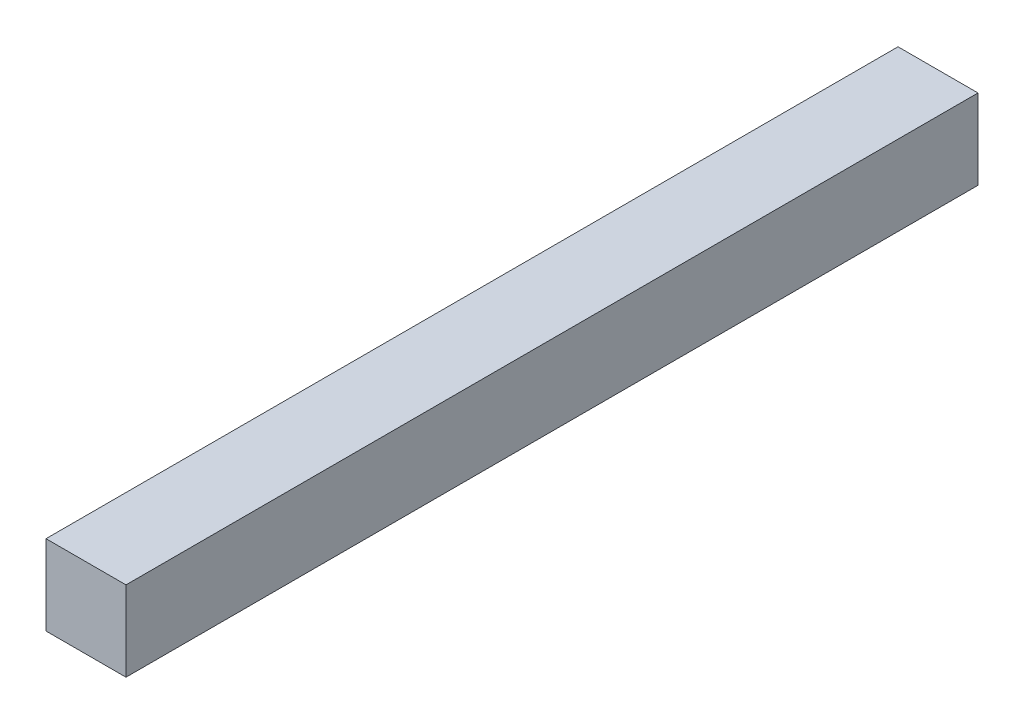
ISO-10303-21;
HEADER;
FILE_DESCRIPTION(('STEP AP214'),'2;1');
FILE_NAME('part.step','',(''),(''),'','','');
FILE_SCHEMA(('AUTOMOTIVE_DESIGN { 1 0 10303 214 1 1 1 1 }'));
ENDSEC;
DATA;
#1=APPLICATION_CONTEXT('core data for automotive mechanical design processes');
#2=APPLICATION_PROTOCOL_DEFINITION('international standard','automotive_design',2000,#1);
#3=PRODUCT_CONTEXT('',#1,'mechanical');
#4=PRODUCT('Part','Part','',(#3));
#5=PRODUCT_RELATED_PRODUCT_CATEGORY('part','',(#4));
#6=PRODUCT_DEFINITION_FORMATION('','',#4);
#7=PRODUCT_DEFINITION_CONTEXT('part definition',#1,'design');
#8=PRODUCT_DEFINITION('design','',#6,#7);
#9=PRODUCT_DEFINITION_SHAPE('','',#8);
#10=(LENGTH_UNIT() NAMED_UNIT(*) SI_UNIT(.MILLI.,.METRE.));
#11=(NAMED_UNIT(*) PLANE_ANGLE_UNIT() SI_UNIT($,.RADIAN.));
#12=(NAMED_UNIT(*) SI_UNIT($,.STERADIAN.) SOLID_ANGLE_UNIT());
#13=UNCERTAINTY_MEASURE_WITH_UNIT(LENGTH_MEASURE(1.E-05),#10,'distance_accuracy_value','');
#14=(GEOMETRIC_REPRESENTATION_CONTEXT(3) GLOBAL_UNCERTAINTY_ASSIGNED_CONTEXT((#13)) GLOBAL_UNIT_ASSIGNED_CONTEXT((#10,
#11,#12)) REPRESENTATION_CONTEXT('',''));
#15=CARTESIAN_POINT('',(0.,0.,0.));
#16=DIRECTION('',(0.,0.,1.));
#17=DIRECTION('',(1.,0.,0.));
#18=AXIS2_PLACEMENT_3D('',#15,#16,#17);
#19=CARTESIAN_POINT('',(0.,0.,0.));
#20=DIRECTION('',(-1.,0.,0.));
#21=DIRECTION('',(0.,0.,1.));
#22=AXIS2_PLACEMENT_3D('',#19,#20,#21);
#23=PLANE('',#22);
#24=DIRECTION('',(0.,0.,-1.));
#25=VECTOR('',#24,1.);
#26=CARTESIAN_POINT('',(0.,0.,0.));
#27=LINE('',#26,#25);
#28=CARTESIAN_POINT('',(0.,0.,0.10651998));
#29=VERTEX_POINT('',#28);
#30=CARTESIAN_POINT('',(0.,0.,0.));
#31=VERTEX_POINT('',#30);
#32=EDGE_CURVE('E20',#29,#31,#27,.T.);
#33=ORIENTED_EDGE('',*,*,#32,.F.);
#34=DIRECTION('',(0.,1.,0.));
#35=VECTOR('',#34,1.);
#36=CARTESIAN_POINT('',(0.,0.,0.10651998));
#37=LINE('',#36,#35);
#38=CARTESIAN_POINT('',(0.,0.009999980000003,0.10651998));
#39=VERTEX_POINT('',#38);
#40=EDGE_CURVE('E80',#39,#29,#37,.F.);
#41=ORIENTED_EDGE('',*,*,#40,.F.);
#42=DIRECTION('',(0.,0.,1.));
#43=VECTOR('',#42,1.);
#44=CARTESIAN_POINT('',(0.,0.009999980000003,0.));
#45=LINE('',#44,#43);
#46=CARTESIAN_POINT('',(0.,0.009999980000003,0.));
#47=VERTEX_POINT('',#46);
#48=EDGE_CURVE('E61',#47,#39,#45,.T.);
#49=ORIENTED_EDGE('',*,*,#48,.F.);
#50=DIRECTION('',(0.,1.,0.));
#51=VECTOR('',#50,1.);
#52=CARTESIAN_POINT('',(0.,0.,0.));
#53=LINE('',#52,#51);
#54=EDGE_CURVE('E55',#47,#31,#53,.F.);
#55=ORIENTED_EDGE('',*,*,#54,.T.);
#56=EDGE_LOOP('',(#33,#41,#49,#55));
#57=FACE_BOUND('',#56,.T.);
#58=ADVANCED_FACE('F17',(#57),#23,.T.);
#59=CARTESIAN_POINT('',(0.009999980000003,0.,0.));
#60=DIRECTION('',(0.,-1.,0.));
#61=DIRECTION('',(0.,0.,-1.));
#62=AXIS2_PLACEMENT_3D('',#59,#60,#61);
#63=PLANE('',#62);
#64=DIRECTION('',(0.,0.,-1.));
#65=VECTOR('',#64,1.);
#66=CARTESIAN_POINT('',(0.009999980000003,0.,0.));
#67=LINE('',#66,#65);
#68=CARTESIAN_POINT('',(0.009999980000003,0.,0.10651998));
#69=VERTEX_POINT('',#68);
#70=CARTESIAN_POINT('',(0.009999980000003,0.,0.));
#71=VERTEX_POINT('',#70);
#72=EDGE_CURVE('E83',#69,#71,#67,.T.);
#73=ORIENTED_EDGE('',*,*,#72,.F.);
#74=DIRECTION('',(1.,0.,0.));
#75=VECTOR('',#74,1.);
#76=CARTESIAN_POINT('',(0.,0.,0.10651998));
#77=LINE('',#76,#75);
#78=EDGE_CURVE('E68',#29,#69,#77,.T.);
#79=ORIENTED_EDGE('',*,*,#78,.F.);
#80=ORIENTED_EDGE('',*,*,#32,.T.);
#81=DIRECTION('',(1.,0.,0.));
#82=VECTOR('',#81,1.);
#83=CARTESIAN_POINT('',(0.,0.,0.));
#84=LINE('',#83,#82);
#85=EDGE_CURVE('E63',#31,#71,#84,.T.);
#86=ORIENTED_EDGE('',*,*,#85,.T.);
#87=EDGE_LOOP('',(#73,#79,#80,#86));
#88=FACE_BOUND('',#87,.T.);
#89=ADVANCED_FACE('F65',(#88),#63,.T.);
#90=CARTESIAN_POINT('',(0.,0.,0.));
#91=DIRECTION('',(0.,0.,1.));
#92=DIRECTION('',(1.,0.,0.));
#93=AXIS2_PLACEMENT_3D('',#90,#91,#92);
#94=PLANE('',#93);
#95=DIRECTION('',(0.,1.,0.));
#96=VECTOR('',#95,1.);
#97=CARTESIAN_POINT('',(0.009999980000003,0.009999980000003,0.));
#98=LINE('',#97,#96);
#99=CARTESIAN_POINT('',(0.009999980000003,0.009999980000003,0.));
#100=VERTEX_POINT('',#99);
#101=EDGE_CURVE('E72',#71,#100,#98,.T.);
#102=ORIENTED_EDGE('',*,*,#101,.F.);
#103=ORIENTED_EDGE('',*,*,#85,.F.);
#104=ORIENTED_EDGE('',*,*,#54,.F.);
#105=DIRECTION('',(1.,0.,0.));
#106=VECTOR('',#105,1.);
#107=CARTESIAN_POINT('',(0.,0.009999980000003,0.));
#108=LINE('',#107,#106);
#109=EDGE_CURVE('E74',#100,#47,#108,.F.);
#110=ORIENTED_EDGE('',*,*,#109,.F.);
#111=EDGE_LOOP('',(#102,#103,#104,#110));
#112=FACE_BOUND('',#111,.T.);
#113=ADVANCED_FACE('F70',(#112),#94,.F.);
#114=CARTESIAN_POINT('',(0.,0.009999980000003,0.));
#115=DIRECTION('',(0.,1.,0.));
#116=DIRECTION('',(0.,0.,1.));
#117=AXIS2_PLACEMENT_3D('',#114,#115,#116);
#118=PLANE('',#117);
#119=ORIENTED_EDGE('',*,*,#48,.T.);
#120=DIRECTION('',(1.,0.,0.));
#121=VECTOR('',#120,1.);
#122=CARTESIAN_POINT('',(0.,0.009999980000003,0.10651998));
#123=LINE('',#122,#121);
#124=CARTESIAN_POINT('',(0.009999980000003,0.009999980000003,0.10651998));
#125=VERTEX_POINT('',#124);
#126=EDGE_CURVE('E35',#125,#39,#123,.F.);
#127=ORIENTED_EDGE('',*,*,#126,.F.);
#128=DIRECTION('',(0.,0.,-1.));
#129=VECTOR('',#128,1.);
#130=CARTESIAN_POINT('',(0.009999980000003,0.009999980000003,0.));
#131=LINE('',#130,#129);
#132=EDGE_CURVE('E26',#100,#125,#131,.F.);
#133=ORIENTED_EDGE('',*,*,#132,.F.);
#134=ORIENTED_EDGE('',*,*,#109,.T.);
#135=EDGE_LOOP('',(#119,#127,#133,#134));
#136=FACE_BOUND('',#135,.T.);
#137=ADVANCED_FACE('F89',(#136),#118,.T.);
#138=CARTESIAN_POINT('',(0.,0.,0.10651998));
#139=DIRECTION('',(0.,0.,1.));
#140=DIRECTION('',(1.,0.,0.));
#141=AXIS2_PLACEMENT_3D('',#138,#139,#140);
#142=PLANE('',#141);
#143=ORIENTED_EDGE('',*,*,#78,.T.);
#144=DIRECTION('',(0.,1.,0.));
#145=VECTOR('',#144,1.);
#146=CARTESIAN_POINT('',(0.009999980000003,0.009999980000003,0.10651998));
#147=LINE('',#146,#145);
#148=EDGE_CURVE('E11',#125,#69,#147,.F.);
#149=ORIENTED_EDGE('',*,*,#148,.F.);
#150=ORIENTED_EDGE('',*,*,#126,.T.);
#151=ORIENTED_EDGE('',*,*,#40,.T.);
#152=EDGE_LOOP('',(#143,#149,#150,#151));
#153=FACE_BOUND('',#152,.T.);
#154=ADVANCED_FACE('F91',(#153),#142,.T.);
#155=CARTESIAN_POINT('',(0.009999980000003,0.009999980000003,0.));
#156=DIRECTION('',(1.,0.,0.));
#157=DIRECTION('',(0.,0.,-1.));
#158=AXIS2_PLACEMENT_3D('',#155,#156,#157);
#159=PLANE('',#158);
#160=ORIENTED_EDGE('',*,*,#132,.T.);
#161=ORIENTED_EDGE('',*,*,#148,.T.);
#162=ORIENTED_EDGE('',*,*,#72,.T.);
#163=ORIENTED_EDGE('',*,*,#101,.T.);
#164=EDGE_LOOP('',(#160,#161,#162,#163));
#165=FACE_BOUND('',#164,.T.);
#166=ADVANCED_FACE('F88',(#165),#159,.T.);
#167=CLOSED_SHELL('',(#58,#89,#113,#137,#154,#166));
#168=MANIFOLD_SOLID_BREP('B1',#167);
#169=ADVANCED_BREP_SHAPE_REPRESENTATION('',(#18,#168),#14);
#170=SHAPE_DEFINITION_REPRESENTATION(#9,#169);
ENDSEC;
END-ISO-10303-21;
